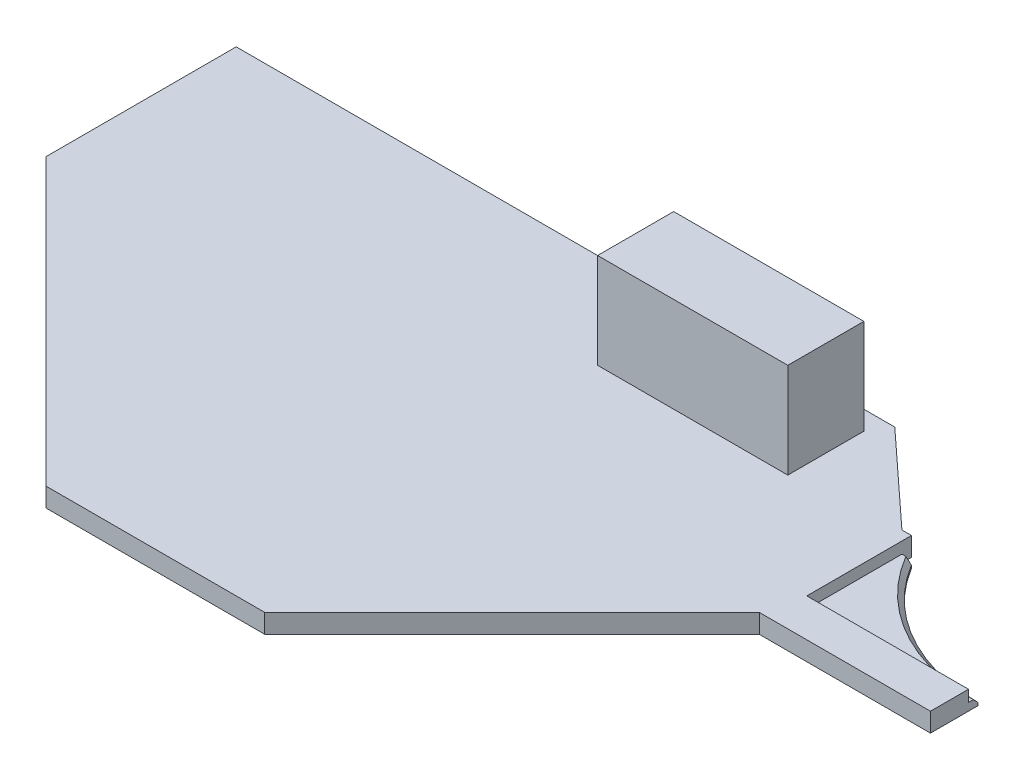
ISO-10303-21;
HEADER;
FILE_DESCRIPTION(('STEP AP214'),'2;1');
FILE_NAME('part.step','',(''),(''),'','','');
FILE_SCHEMA(('AUTOMOTIVE_DESIGN { 1 0 10303 214 1 1 1 1 }'));
ENDSEC;
DATA;
#1=APPLICATION_CONTEXT('core data for automotive mechanical design processes');
#2=APPLICATION_PROTOCOL_DEFINITION('international standard','automotive_design',2000,#1);
#3=PRODUCT_CONTEXT('',#1,'mechanical');
#4=PRODUCT('Part','Part','',(#3));
#5=PRODUCT_RELATED_PRODUCT_CATEGORY('part','',(#4));
#6=PRODUCT_DEFINITION_FORMATION('','',#4);
#7=PRODUCT_DEFINITION_CONTEXT('part definition',#1,'design');
#8=PRODUCT_DEFINITION('design','',#6,#7);
#9=PRODUCT_DEFINITION_SHAPE('','',#8);
#10=(LENGTH_UNIT() NAMED_UNIT(*) SI_UNIT(.MILLI.,.METRE.));
#11=(NAMED_UNIT(*) PLANE_ANGLE_UNIT() SI_UNIT($,.RADIAN.));
#12=(NAMED_UNIT(*) SI_UNIT($,.STERADIAN.) SOLID_ANGLE_UNIT());
#13=UNCERTAINTY_MEASURE_WITH_UNIT(LENGTH_MEASURE(1.E-05),#10,'distance_accuracy_value','');
#14=(GEOMETRIC_REPRESENTATION_CONTEXT(3) GLOBAL_UNCERTAINTY_ASSIGNED_CONTEXT((#13)) GLOBAL_UNIT_ASSIGNED_CONTEXT((#10,
#11,#12)) REPRESENTATION_CONTEXT('',''));
#15=CARTESIAN_POINT('',(0.,0.,0.));
#16=DIRECTION('',(0.,0.,1.));
#17=DIRECTION('',(1.,0.,0.));
#18=AXIS2_PLACEMENT_3D('',#15,#16,#17);
#19=CARTESIAN_POINT('',(0.,2.,0.));
#20=DIRECTION('',(0.,1.,0.));
#21=DIRECTION('',(0.,0.,1.));
#22=AXIS2_PLACEMENT_3D('',#19,#20,#21);
#23=PLANE('',#22);
#24=DIRECTION('',(0.,0.,1.));
#25=VECTOR('',#24,1.);
#26=CARTESIAN_POINT('',(80.,2.,-11.));
#27=LINE('',#26,#25);
#28=CARTESIAN_POINT('',(80.,2.,-11.));
#29=VERTEX_POINT('',#28);
#30=CARTESIAN_POINT('',(80.,2.,0.));
#31=VERTEX_POINT('',#30);
#32=EDGE_CURVE('E222',#29,#31,#27,.T.);
#33=ORIENTED_EDGE('',*,*,#32,.F.);
#34=DIRECTION('',(-1.,0.,0.));
#35=VECTOR('',#34,1.);
#36=CARTESIAN_POINT('',(79.,2.,-11.));
#37=LINE('',#36,#35);
#38=CARTESIAN_POINT('',(79.,2.,-11.));
#39=VERTEX_POINT('',#38);
#40=EDGE_CURVE('E259',#29,#39,#37,.T.);
#41=ORIENTED_EDGE('',*,*,#40,.T.);
#42=DIRECTION('',(-0.734803444627488,0.,-0.678280102733066));
#43=VECTOR('',#42,1.);
#44=CARTESIAN_POINT('',(69.25,2.,-20.));
#45=LINE('',#44,#43);
#46=CARTESIAN_POINT('',(69.25,2.,-20.));
#47=VERTEX_POINT('',#46);
#48=EDGE_CURVE('E261',#39,#47,#45,.T.);
#49=ORIENTED_EDGE('',*,*,#48,.T.);
#50=DIRECTION('',(-1.,0.,0.));
#51=VECTOR('',#50,1.);
#52=CARTESIAN_POINT('',(0.,2.,-20.));
#53=LINE('',#52,#51);
#54=CARTESIAN_POINT('',(0.,2.,-20.));
#55=VERTEX_POINT('',#54);
#56=EDGE_CURVE('E263',#47,#55,#53,.T.);
#57=ORIENTED_EDGE('',*,*,#56,.T.);
#58=DIRECTION('',(0.,0.,1.));
#59=VECTOR('',#58,1.);
#60=CARTESIAN_POINT('',(0.,2.,0.));
#61=LINE('',#60,#59);
#62=CARTESIAN_POINT('',(0.,2.,0.));
#63=VERTEX_POINT('',#62);
#64=EDGE_CURVE('E265',#55,#63,#61,.T.);
#65=ORIENTED_EDGE('',*,*,#64,.T.);
#66=DIRECTION('',(0.707106781186547,0.,0.707106781186548));
#67=VECTOR('',#66,1.);
#68=CARTESIAN_POINT('',(30.,2.,30.));
#69=LINE('',#68,#67);
#70=CARTESIAN_POINT('',(30.,2.,30.));
#71=VERTEX_POINT('',#70);
#72=EDGE_CURVE('E246',#63,#71,#69,.T.);
#73=ORIENTED_EDGE('',*,*,#72,.T.);
#74=DIRECTION('',(1.,0.,0.));
#75=VECTOR('',#74,1.);
#76=CARTESIAN_POINT('',(53.,2.,30.));
#77=LINE('',#76,#75);
#78=CARTESIAN_POINT('',(53.,2.,30.));
#79=VERTEX_POINT('',#78);
#80=EDGE_CURVE('E249',#71,#79,#77,.T.);
#81=ORIENTED_EDGE('',*,*,#80,.T.);
#82=DIRECTION('',(0.707106781186548,0.,-0.707106781186548));
#83=VECTOR('',#82,1.);
#84=CARTESIAN_POINT('',(79.,2.,4.));
#85=LINE('',#84,#83);
#86=CARTESIAN_POINT('',(79.,2.,4.));
#87=VERTEX_POINT('',#86);
#88=EDGE_CURVE('E252',#79,#87,#85,.T.);
#89=ORIENTED_EDGE('',*,*,#88,.T.);
#90=DIRECTION('',(1.,0.,0.));
#91=VECTOR('',#90,1.);
#92=CARTESIAN_POINT('',(79.,2.,4.));
#93=LINE('',#92,#91);
#94=CARTESIAN_POINT('',(97.,2.,4.));
#95=VERTEX_POINT('',#94);
#96=EDGE_CURVE('E254',#87,#95,#93,.T.);
#97=ORIENTED_EDGE('',*,*,#96,.T.);
#98=DIRECTION('',(0.,0.,-1.));
#99=VECTOR('',#98,1.);
#100=CARTESIAN_POINT('',(97.,2.,4.));
#101=LINE('',#100,#99);
#102=CARTESIAN_POINT('',(97.,2.,0.));
#103=VERTEX_POINT('',#102);
#104=EDGE_CURVE('E256',#95,#103,#101,.T.);
#105=ORIENTED_EDGE('',*,*,#104,.T.);
#106=DIRECTION('',(1.,0.,0.));
#107=VECTOR('',#106,1.);
#108=CARTESIAN_POINT('',(80.,2.,0.));
#109=LINE('',#108,#107);
#110=EDGE_CURVE('E235',#31,#103,#109,.T.);
#111=ORIENTED_EDGE('',*,*,#110,.F.);
#112=EDGE_LOOP('',(#33,#41,#49,#57,#65,#73,#81,#89,#97,#105,#111));
#113=FACE_BOUND('',#112,.T.);
#114=DIRECTION('',(0.,0.,-1.));
#115=VECTOR('',#114,1.);
#116=CARTESIAN_POINT('',(68.,2.,0.));
#117=LINE('',#116,#115);
#118=CARTESIAN_POINT('',(68.,2.,-9.99999999999999));
#119=VERTEX_POINT('',#118);
#120=CARTESIAN_POINT('',(68.,2.,-18.));
#121=VERTEX_POINT('',#120);
#122=EDGE_CURVE('E442',#119,#121,#117,.T.);
#123=ORIENTED_EDGE('',*,*,#122,.F.);
#124=DIRECTION('',(1.,0.,0.));
#125=VECTOR('',#124,1.);
#126=CARTESIAN_POINT('',(0.,2.,-9.99999999999999));
#127=LINE('',#126,#125);
#128=CARTESIAN_POINT('',(48.,2.,-9.99999999999999));
#129=VERTEX_POINT('',#128);
#130=EDGE_CURVE('E201',#129,#119,#127,.T.);
#131=ORIENTED_EDGE('',*,*,#130,.F.);
#132=DIRECTION('',(0.,0.,1.));
#133=VECTOR('',#132,1.);
#134=CARTESIAN_POINT('',(48.,2.,0.));
#135=LINE('',#134,#133);
#136=CARTESIAN_POINT('',(48.,2.,-18.));
#137=VERTEX_POINT('',#136);
#138=EDGE_CURVE('E197',#137,#129,#135,.T.);
#139=ORIENTED_EDGE('',*,*,#138,.F.);
#140=DIRECTION('',(-1.,0.,0.));
#141=VECTOR('',#140,1.);
#142=CARTESIAN_POINT('',(0.,2.,-18.));
#143=LINE('',#142,#141);
#144=EDGE_CURVE('E439',#121,#137,#143,.T.);
#145=ORIENTED_EDGE('',*,*,#144,.F.);
#146=EDGE_LOOP('',(#123,#131,#139,#145));
#147=FACE_BOUND('',#146,.T.);
#148=ADVANCED_FACE('F43',(#113,#147),#23,.T.);
#149=CARTESIAN_POINT('',(30.,2.,30.));
#150=DIRECTION('',(0.707106781186548,0.,-0.707106781186547));
#151=DIRECTION('',(-0.707106781186547,0.,-0.707106781186548));
#152=AXIS2_PLACEMENT_3D('',#149,#150,#151);
#153=PLANE('',#152);
#154=DIRECTION('',(0.707106781186547,0.,0.707106781186548));
#155=VECTOR('',#154,1.);
#156=CARTESIAN_POINT('',(30.,0.,30.));
#157=LINE('',#156,#155);
#158=CARTESIAN_POINT('',(0.,0.,0.));
#159=VERTEX_POINT('',#158);
#160=CARTESIAN_POINT('',(30.,0.,30.));
#161=VERTEX_POINT('',#160);
#162=EDGE_CURVE('E245',#159,#161,#157,.T.);
#163=ORIENTED_EDGE('',*,*,#162,.T.);
#164=DIRECTION('',(0.,-1.,0.));
#165=VECTOR('',#164,1.);
#166=CARTESIAN_POINT('',(30.,2.,30.));
#167=LINE('',#166,#165);
#168=EDGE_CURVE('E306',#71,#161,#167,.T.);
#169=ORIENTED_EDGE('',*,*,#168,.F.);
#170=ORIENTED_EDGE('',*,*,#72,.F.);
#171=DIRECTION('',(0.,-1.,0.));
#172=VECTOR('',#171,1.);
#173=CARTESIAN_POINT('',(0.,2.,0.));
#174=LINE('',#173,#172);
#175=EDGE_CURVE('E267',#63,#159,#174,.T.);
#176=ORIENTED_EDGE('',*,*,#175,.T.);
#177=EDGE_LOOP('',(#163,#169,#170,#176));
#178=FACE_BOUND('',#177,.T.);
#179=ADVANCED_FACE('F338',(#178),#153,.F.);
#180=CARTESIAN_POINT('',(53.,2.,30.));
#181=DIRECTION('',(0.,0.,-1.));
#182=DIRECTION('',(-1.,0.,0.));
#183=AXIS2_PLACEMENT_3D('',#180,#181,#182);
#184=PLANE('',#183);
#185=DIRECTION('',(1.,0.,0.));
#186=VECTOR('',#185,1.);
#187=CARTESIAN_POINT('',(53.,0.,30.));
#188=LINE('',#187,#186);
#189=CARTESIAN_POINT('',(53.,0.,30.));
#190=VERTEX_POINT('',#189);
#191=EDGE_CURVE('E270',#161,#190,#188,.T.);
#192=ORIENTED_EDGE('',*,*,#191,.T.);
#193=DIRECTION('',(0.,-1.,0.));
#194=VECTOR('',#193,1.);
#195=CARTESIAN_POINT('',(53.,2.,30.));
#196=LINE('',#195,#194);
#197=EDGE_CURVE('E303',#79,#190,#196,.T.);
#198=ORIENTED_EDGE('',*,*,#197,.F.);
#199=ORIENTED_EDGE('',*,*,#80,.F.);
#200=ORIENTED_EDGE('',*,*,#168,.T.);
#201=EDGE_LOOP('',(#192,#198,#199,#200));
#202=FACE_BOUND('',#201,.T.);
#203=ADVANCED_FACE('F344',(#202),#184,.F.);
#204=CARTESIAN_POINT('',(79.,2.,4.));
#205=DIRECTION('',(-0.707106781186548,0.,-0.707106781186547));
#206=DIRECTION('',(-0.707106781186547,0.,0.707106781186548));
#207=AXIS2_PLACEMENT_3D('',#204,#205,#206);
#208=PLANE('',#207);
#209=DIRECTION('',(0.707106781186548,0.,-0.707106781186548));
#210=VECTOR('',#209,1.);
#211=CARTESIAN_POINT('',(79.,0.,4.));
#212=LINE('',#211,#210);
#213=CARTESIAN_POINT('',(79.,0.,4.));
#214=VERTEX_POINT('',#213);
#215=EDGE_CURVE('E272',#190,#214,#212,.T.);
#216=ORIENTED_EDGE('',*,*,#215,.T.);
#217=DIRECTION('',(0.,-1.,0.));
#218=VECTOR('',#217,1.);
#219=CARTESIAN_POINT('',(79.,2.,4.));
#220=LINE('',#219,#218);
#221=EDGE_CURVE('E300',#87,#214,#220,.T.);
#222=ORIENTED_EDGE('',*,*,#221,.F.);
#223=ORIENTED_EDGE('',*,*,#88,.F.);
#224=ORIENTED_EDGE('',*,*,#197,.T.);
#225=EDGE_LOOP('',(#216,#222,#223,#224));
#226=FACE_BOUND('',#225,.T.);
#227=ADVANCED_FACE('F375',(#226),#208,.F.);
#228=CARTESIAN_POINT('',(79.,2.,4.));
#229=DIRECTION('',(0.,0.,-1.));
#230=DIRECTION('',(-1.,0.,0.));
#231=AXIS2_PLACEMENT_3D('',#228,#229,#230);
#232=PLANE('',#231);
#233=DIRECTION('',(1.,0.,0.));
#234=VECTOR('',#233,1.);
#235=CARTESIAN_POINT('',(79.,0.,4.));
#236=LINE('',#235,#234);
#237=CARTESIAN_POINT('',(97.,0.,4.));
#238=VERTEX_POINT('',#237);
#239=EDGE_CURVE('E274',#214,#238,#236,.T.);
#240=ORIENTED_EDGE('',*,*,#239,.T.);
#241=DIRECTION('',(0.,-1.,0.));
#242=VECTOR('',#241,1.);
#243=CARTESIAN_POINT('',(97.,2.,4.));
#244=LINE('',#243,#242);
#245=EDGE_CURVE('E297',#95,#238,#244,.T.);
#246=ORIENTED_EDGE('',*,*,#245,.F.);
#247=ORIENTED_EDGE('',*,*,#96,.F.);
#248=ORIENTED_EDGE('',*,*,#221,.T.);
#249=EDGE_LOOP('',(#240,#246,#247,#248));
#250=FACE_BOUND('',#249,.T.);
#251=ADVANCED_FACE('F372',(#250),#232,.F.);
#252=CARTESIAN_POINT('',(97.,2.,4.));
#253=DIRECTION('',(-1.,0.,0.));
#254=DIRECTION('',(0.,0.,1.));
#255=AXIS2_PLACEMENT_3D('',#252,#253,#254);
#256=PLANE('',#255);
#257=DIRECTION('',(0.,1.,0.));
#258=VECTOR('',#257,1.);
#259=CARTESIAN_POINT('',(97.,0.,-1.));
#260=LINE('',#259,#258);
#261=CARTESIAN_POINT('',(97.,0.,-1.));
#262=VERTEX_POINT('',#261);
#263=CARTESIAN_POINT('',(97.,0.299999999999992,-1.));
#264=VERTEX_POINT('',#263);
#265=EDGE_CURVE('E220',#262,#264,#260,.T.);
#266=ORIENTED_EDGE('',*,*,#265,.T.);
#267=DIRECTION('',(0.,0.707106781186545,0.70710678118655));
#268=VECTOR('',#267,1.);
#269=CARTESIAN_POINT('',(97.,-18.4222222222221,-19.7222222222222));
#270=LINE('',#269,#268);
#271=CARTESIAN_POINT('',(97.,0.799999999999999,-0.499999999999994));
#272=VERTEX_POINT('',#271);
#273=EDGE_CURVE('E70',#264,#272,#270,.T.);
#274=ORIENTED_EDGE('',*,*,#273,.T.);
#275=DIRECTION('',(0.,0.,1.));
#276=VECTOR('',#275,1.);
#277=CARTESIAN_POINT('',(97.,0.799999999999999,-11.));
#278=LINE('',#277,#276);
#279=CARTESIAN_POINT('',(97.,0.799999999999999,0.));
#280=VERTEX_POINT('',#279);
#281=EDGE_CURVE('E227',#272,#280,#278,.T.);
#282=ORIENTED_EDGE('',*,*,#281,.T.);
#283=DIRECTION('',(0.,1.,0.));
#284=VECTOR('',#283,1.);
#285=CARTESIAN_POINT('',(97.,-20.2484567313166,0.));
#286=LINE('',#285,#284);
#287=EDGE_CURVE('E239',#280,#103,#286,.T.);
#288=ORIENTED_EDGE('',*,*,#287,.T.);
#289=ORIENTED_EDGE('',*,*,#104,.F.);
#290=ORIENTED_EDGE('',*,*,#245,.T.);
#291=DIRECTION('',(0.,0.,-1.));
#292=VECTOR('',#291,1.);
#293=CARTESIAN_POINT('',(97.,0.,4.));
#294=LINE('',#293,#292);
#295=EDGE_CURVE('E276',#238,#262,#294,.T.);
#296=ORIENTED_EDGE('',*,*,#295,.T.);
#297=EDGE_LOOP('',(#266,#274,#282,#288,#289,#290,#296));
#298=FACE_BOUND('',#297,.T.);
#299=ADVANCED_FACE('F318',(#298),#256,.F.);
#300=CARTESIAN_POINT('',(79.,2.,-11.));
#301=DIRECTION('',(0.,0.,1.));
#302=DIRECTION('',(1.,0.,0.));
#303=AXIS2_PLACEMENT_3D('',#300,#301,#302);
#304=PLANE('',#303);
#305=DIRECTION('',(0.,1.,0.));
#306=VECTOR('',#305,1.);
#307=CARTESIAN_POINT('',(80.,-20.2484567313166,-11.));
#308=LINE('',#307,#306);
#309=CARTESIAN_POINT('',(80.,0.,-11.));
#310=VERTEX_POINT('',#309);
#311=EDGE_CURVE('E230',#310,#29,#308,.T.);
#312=ORIENTED_EDGE('',*,*,#311,.F.);
#313=DIRECTION('',(-1.,0.,0.));
#314=VECTOR('',#313,1.);
#315=CARTESIAN_POINT('',(79.,0.,-11.));
#316=LINE('',#315,#314);
#317=CARTESIAN_POINT('',(79.,0.,-11.));
#318=VERTEX_POINT('',#317);
#319=EDGE_CURVE('E279',#310,#318,#316,.T.);
#320=ORIENTED_EDGE('',*,*,#319,.T.);
#321=DIRECTION('',(0.,-1.,0.));
#322=VECTOR('',#321,1.);
#323=CARTESIAN_POINT('',(79.,2.,-11.));
#324=LINE('',#323,#322);
#325=EDGE_CURVE('E294',#39,#318,#324,.T.);
#326=ORIENTED_EDGE('',*,*,#325,.F.);
#327=ORIENTED_EDGE('',*,*,#40,.F.);
#328=EDGE_LOOP('',(#312,#320,#326,#327));
#329=FACE_BOUND('',#328,.T.);
#330=ADVANCED_FACE('F365',(#329),#304,.F.);
#331=CARTESIAN_POINT('',(69.25,2.,-20.));
#332=DIRECTION('',(-0.678280102733066,0.,0.734803444627488));
#333=DIRECTION('',(0.734803444627488,0.,0.678280102733066));
#334=AXIS2_PLACEMENT_3D('',#331,#332,#333);
#335=PLANE('',#334);
#336=DIRECTION('',(-0.734803444627488,0.,-0.678280102733066));
#337=VECTOR('',#336,1.);
#338=CARTESIAN_POINT('',(69.25,0.,-20.));
#339=LINE('',#338,#337);
#340=CARTESIAN_POINT('',(69.25,0.,-20.));
#341=VERTEX_POINT('',#340);
#342=EDGE_CURVE('E281',#318,#341,#339,.T.);
#343=ORIENTED_EDGE('',*,*,#342,.T.);
#344=DIRECTION('',(0.,-1.,0.));
#345=VECTOR('',#344,1.);
#346=CARTESIAN_POINT('',(69.25,2.,-20.));
#347=LINE('',#346,#345);
#348=EDGE_CURVE('E291',#47,#341,#347,.T.);
#349=ORIENTED_EDGE('',*,*,#348,.F.);
#350=ORIENTED_EDGE('',*,*,#48,.F.);
#351=ORIENTED_EDGE('',*,*,#325,.T.);
#352=EDGE_LOOP('',(#343,#349,#350,#351));
#353=FACE_BOUND('',#352,.T.);
#354=ADVANCED_FACE('F361',(#353),#335,.F.);
#355=CARTESIAN_POINT('',(0.,2.,-20.));
#356=DIRECTION('',(0.,0.,1.));
#357=DIRECTION('',(1.,0.,0.));
#358=AXIS2_PLACEMENT_3D('',#355,#356,#357);
#359=PLANE('',#358);
#360=DIRECTION('',(-1.,0.,0.));
#361=VECTOR('',#360,1.);
#362=CARTESIAN_POINT('',(0.,0.,-20.));
#363=LINE('',#362,#361);
#364=CARTESIAN_POINT('',(0.,0.,-20.));
#365=VERTEX_POINT('',#364);
#366=EDGE_CURVE('E283',#341,#365,#363,.T.);
#367=ORIENTED_EDGE('',*,*,#366,.T.);
#368=DIRECTION('',(0.,-1.,0.));
#369=VECTOR('',#368,1.);
#370=CARTESIAN_POINT('',(0.,2.,-20.));
#371=LINE('',#370,#369);
#372=EDGE_CURVE('E288',#55,#365,#371,.T.);
#373=ORIENTED_EDGE('',*,*,#372,.F.);
#374=ORIENTED_EDGE('',*,*,#56,.F.);
#375=ORIENTED_EDGE('',*,*,#348,.T.);
#376=EDGE_LOOP('',(#367,#373,#374,#375));
#377=FACE_BOUND('',#376,.T.);
#378=ADVANCED_FACE('F357',(#377),#359,.F.);
#379=CARTESIAN_POINT('',(0.,2.,0.));
#380=DIRECTION('',(1.,0.,0.));
#381=DIRECTION('',(0.,0.,-1.));
#382=AXIS2_PLACEMENT_3D('',#379,#380,#381);
#383=PLANE('',#382);
#384=DIRECTION('',(0.,0.,1.));
#385=VECTOR('',#384,1.);
#386=CARTESIAN_POINT('',(0.,0.,0.));
#387=LINE('',#386,#385);
#388=EDGE_CURVE('E250',#365,#159,#387,.T.);
#389=ORIENTED_EDGE('',*,*,#388,.T.);
#390=ORIENTED_EDGE('',*,*,#175,.F.);
#391=ORIENTED_EDGE('',*,*,#64,.F.);
#392=ORIENTED_EDGE('',*,*,#372,.T.);
#393=EDGE_LOOP('',(#389,#390,#391,#392));
#394=FACE_BOUND('',#393,.T.);
#395=ADVANCED_FACE('F354',(#394),#383,.F.);
#396=CARTESIAN_POINT('',(0.,0.,0.));
#397=DIRECTION('',(0.,1.,0.));
#398=DIRECTION('',(0.,0.,1.));
#399=AXIS2_PLACEMENT_3D('',#396,#397,#398);
#400=PLANE('',#399);
#401=DIRECTION('',(1.,0.,0.));
#402=VECTOR('',#401,1.);
#403=CARTESIAN_POINT('',(80.,0.,-10.));
#404=LINE('',#403,#402);
#405=CARTESIAN_POINT('',(80.,0.,-10.));
#406=VERTEX_POINT('',#405);
#407=CARTESIAN_POINT('',(81.,0.,-10.));
#408=VERTEX_POINT('',#407);
#409=EDGE_CURVE('E213',#406,#408,#404,.T.);
#410=ORIENTED_EDGE('',*,*,#409,.T.);
#411=CARTESIAN_POINT('',(97.,0.,-19.7222222222222));
#412=DIRECTION('',(0.,1.,0.));
#413=DIRECTION('',(0.,0.,1.));
#414=AXIS2_PLACEMENT_3D('',#411,#412,#413);
#415=CIRCLE('',#414,18.7222222222222);
#416=EDGE_CURVE('E216',#408,#262,#415,.T.);
#417=ORIENTED_EDGE('',*,*,#416,.T.);
#418=ORIENTED_EDGE('',*,*,#295,.F.);
#419=ORIENTED_EDGE('',*,*,#239,.F.);
#420=ORIENTED_EDGE('',*,*,#215,.F.);
#421=ORIENTED_EDGE('',*,*,#191,.F.);
#422=ORIENTED_EDGE('',*,*,#162,.F.);
#423=ORIENTED_EDGE('',*,*,#388,.F.);
#424=ORIENTED_EDGE('',*,*,#366,.F.);
#425=ORIENTED_EDGE('',*,*,#342,.F.);
#426=ORIENTED_EDGE('',*,*,#319,.F.);
#427=DIRECTION('',(0.,0.,1.));
#428=VECTOR('',#427,1.);
#429=CARTESIAN_POINT('',(80.,0.,-11.));
#430=LINE('',#429,#428);
#431=EDGE_CURVE('E205',#310,#406,#430,.T.);
#432=ORIENTED_EDGE('',*,*,#431,.T.);
#433=EDGE_LOOP('',(#410,#417,#418,#419,#420,#421,#422,#423,#424,#425,#426,#432));
#434=FACE_BOUND('',#433,.T.);
#435=ADVANCED_FACE('F324',(#434),#400,.F.);
#436=CARTESIAN_POINT('',(80.,-20.2484567313166,-11.));
#437=DIRECTION('',(-1.,0.,0.));
#438=DIRECTION('',(0.,0.,1.));
#439=AXIS2_PLACEMENT_3D('',#436,#437,#438);
#440=PLANE('',#439);
#441=DIRECTION('',(0.,0.,-1.));
#442=VECTOR('',#441,1.);
#443=CARTESIAN_POINT('',(80.,0.799999999999999,-11.));
#444=LINE('',#443,#442);
#445=CARTESIAN_POINT('',(80.,0.799999999999999,0.));
#446=VERTEX_POINT('',#445);
#447=CARTESIAN_POINT('',(80.,0.8,-10.));
#448=VERTEX_POINT('',#447);
#449=EDGE_CURVE('E229',#446,#448,#444,.T.);
#450=ORIENTED_EDGE('',*,*,#449,.T.);
#451=DIRECTION('',(0.,1.,0.));
#452=VECTOR('',#451,1.);
#453=CARTESIAN_POINT('',(80.,0.,-10.));
#454=LINE('',#453,#452);
#455=EDGE_CURVE('E218',#406,#448,#454,.T.);
#456=ORIENTED_EDGE('',*,*,#455,.F.);
#457=ORIENTED_EDGE('',*,*,#431,.F.);
#458=ORIENTED_EDGE('',*,*,#311,.T.);
#459=ORIENTED_EDGE('',*,*,#32,.T.);
#460=DIRECTION('',(0.,1.,0.));
#461=VECTOR('',#460,1.);
#462=CARTESIAN_POINT('',(80.,-20.2484567313166,0.));
#463=LINE('',#462,#461);
#464=EDGE_CURVE('E237',#446,#31,#463,.T.);
#465=ORIENTED_EDGE('',*,*,#464,.F.);
#466=EDGE_LOOP('',(#450,#456,#457,#458,#459,#465));
#467=FACE_BOUND('',#466,.T.);
#468=ADVANCED_FACE('F350',(#467),#440,.F.);
#469=CARTESIAN_POINT('',(80.,-20.2484567313166,0.));
#470=DIRECTION('',(0.,0.,1.));
#471=DIRECTION('',(1.,0.,0.));
#472=AXIS2_PLACEMENT_3D('',#469,#470,#471);
#473=PLANE('',#472);
#474=DIRECTION('',(-1.,0.,0.));
#475=VECTOR('',#474,1.);
#476=CARTESIAN_POINT('',(80.,0.799999999999999,0.));
#477=LINE('',#476,#475);
#478=EDGE_CURVE('E233',#280,#446,#477,.T.);
#479=ORIENTED_EDGE('',*,*,#478,.T.);
#480=ORIENTED_EDGE('',*,*,#464,.T.);
#481=ORIENTED_EDGE('',*,*,#110,.T.);
#482=ORIENTED_EDGE('',*,*,#287,.F.);
#483=EDGE_LOOP('',(#479,#480,#481,#482));
#484=FACE_BOUND('',#483,.T.);
#485=ADVANCED_FACE('F409',(#484),#473,.F.);
#486=CARTESIAN_POINT('',(0.,0.8,0.));
#487=DIRECTION('',(0.,1.,0.));
#488=DIRECTION('',(0.,0.,1.));
#489=AXIS2_PLACEMENT_3D('',#486,#487,#488);
#490=PLANE('',#489);
#491=ORIENTED_EDGE('',*,*,#281,.F.);
#492=CARTESIAN_POINT('',(97.,0.8,-19.7222222222222));
#493=DIRECTION('',(0.,1.,0.));
#494=DIRECTION('',(0.,0.,1.));
#495=AXIS2_PLACEMENT_3D('',#492,#493,#494);
#496=CIRCLE('',#495,19.2222222222222);
#497=CARTESIAN_POINT('',(80.4177136008866,0.8,-10.));
#498=VERTEX_POINT('',#497);
#499=EDGE_CURVE('E56',#272,#498,#496,.F.);
#500=ORIENTED_EDGE('',*,*,#499,.T.);
#501=DIRECTION('',(1.,0.,0.));
#502=VECTOR('',#501,1.);
#503=CARTESIAN_POINT('',(80.,0.8,-10.));
#504=LINE('',#503,#502);
#505=EDGE_CURVE('E203',#448,#498,#504,.T.);
#506=ORIENTED_EDGE('',*,*,#505,.F.);
#507=ORIENTED_EDGE('',*,*,#449,.F.);
#508=ORIENTED_EDGE('',*,*,#478,.F.);
#509=EDGE_LOOP('',(#491,#500,#506,#507,#508));
#510=FACE_BOUND('',#509,.T.);
#511=ADVANCED_FACE('F406',(#510),#490,.T.);
#512=CARTESIAN_POINT('',(97.,0.,-19.7222222222222));
#513=DIRECTION('',(0.,1.,0.));
#514=DIRECTION('',(0.,0.,1.));
#515=AXIS2_PLACEMENT_3D('',#512,#513,#514);
#516=CYLINDRICAL_SURFACE('',#515,18.7222222222222);
#517=DIRECTION('',(0.,1.,0.));
#518=VECTOR('',#517,1.);
#519=CARTESIAN_POINT('',(81.,0.,-10.));
#520=LINE('',#519,#518);
#521=CARTESIAN_POINT('',(81.,0.299999999999988,-10.));
#522=VERTEX_POINT('',#521);
#523=EDGE_CURVE('E223',#408,#522,#520,.T.);
#524=ORIENTED_EDGE('',*,*,#523,.T.);
#525=CARTESIAN_POINT('',(97.,0.299999999999989,-19.7222222222222));
#526=DIRECTION('',(0.,1.,0.));
#527=DIRECTION('',(0.,0.,1.));
#528=AXIS2_PLACEMENT_3D('',#525,#526,#527);
#529=CIRCLE('',#528,18.7222222222222);
#530=EDGE_CURVE('E309',#522,#264,#529,.T.);
#531=ORIENTED_EDGE('',*,*,#530,.T.);
#532=ORIENTED_EDGE('',*,*,#265,.F.);
#533=ORIENTED_EDGE('',*,*,#416,.F.);
#534=EDGE_LOOP('',(#524,#531,#532,#533));
#535=FACE_BOUND('',#534,.T.);
#536=ADVANCED_FACE('F314',(#535),#516,.F.);
#537=CARTESIAN_POINT('',(80.,0.,-10.));
#538=DIRECTION('',(0.,0.,1.));
#539=DIRECTION('',(1.,0.,0.));
#540=AXIS2_PLACEMENT_3D('',#537,#538,#539);
#541=PLANE('',#540);
#542=ORIENTED_EDGE('',*,*,#505,.T.);
#543=CARTESIAN_POINT('',(80.4177136008866,0.8,-10.));
#544=CARTESIAN_POINT('',(80.514567992752,0.716441510106282,-10.));
#545=CARTESIAN_POINT('',(80.6115190544153,0.632995599229627,-10.));
#546=CARTESIAN_POINT('',(80.8056145207795,0.466328932554971,-10.));
#547=CARTESIAN_POINT('',(80.9027589254874,0.383108176764955,-10.));
#548=CARTESIAN_POINT('',(81.,0.299999999999987,-10.));
#549=B_SPLINE_CURVE_WITH_KNOTS('',3,(#543,#544,#545,#546,#547,#548),.UNSPECIFIED.,.F.,.F.,(4,2,
4),(0.,0.383750642471212,0.7675012985524),.UNSPECIFIED.);
#550=EDGE_CURVE('E12',#498,#522,#549,.T.);
#551=ORIENTED_EDGE('',*,*,#550,.T.);
#552=ORIENTED_EDGE('',*,*,#523,.F.);
#553=ORIENTED_EDGE('',*,*,#409,.F.);
#554=ORIENTED_EDGE('',*,*,#455,.T.);
#555=EDGE_LOOP('',(#542,#551,#552,#553,#554));
#556=FACE_BOUND('',#555,.T.);
#557=ADVANCED_FACE('F330',(#556),#541,.F.);
#558=CARTESIAN_POINT('',(0.,12.,-9.99999999999999));
#559=DIRECTION('',(0.,0.,-1.));
#560=DIRECTION('',(-1.,0.,0.));
#561=AXIS2_PLACEMENT_3D('',#558,#559,#560);
#562=PLANE('',#561);
#563=ORIENTED_EDGE('',*,*,#130,.T.);
#564=DIRECTION('',(0.,-1.,0.));
#565=VECTOR('',#564,1.);
#566=CARTESIAN_POINT('',(68.,12.,-9.99999999999999));
#567=LINE('',#566,#565);
#568=CARTESIAN_POINT('',(68.,12.,-9.99999999999999));
#569=VERTEX_POINT('',#568);
#570=EDGE_CURVE('E181',#569,#119,#567,.T.);
#571=ORIENTED_EDGE('',*,*,#570,.F.);
#572=DIRECTION('',(1.,0.,0.));
#573=VECTOR('',#572,1.);
#574=CARTESIAN_POINT('',(0.,12.,-9.99999999999999));
#575=LINE('',#574,#573);
#576=CARTESIAN_POINT('',(48.,12.,-9.99999999999999));
#577=VERTEX_POINT('',#576);
#578=EDGE_CURVE('E188',#577,#569,#575,.T.);
#579=ORIENTED_EDGE('',*,*,#578,.F.);
#580=DIRECTION('',(0.,-1.,0.));
#581=VECTOR('',#580,1.);
#582=CARTESIAN_POINT('',(48.,12.,-9.99999999999999));
#583=LINE('',#582,#581);
#584=EDGE_CURVE('E435',#577,#129,#583,.T.);
#585=ORIENTED_EDGE('',*,*,#584,.T.);
#586=EDGE_LOOP('',(#563,#571,#579,#585));
#587=FACE_BOUND('',#586,.T.);
#588=ADVANCED_FACE('F199',(#587),#562,.F.);
#589=CARTESIAN_POINT('',(68.,12.,0.));
#590=DIRECTION('',(-1.,0.,0.));
#591=DIRECTION('',(0.,0.,1.));
#592=AXIS2_PLACEMENT_3D('',#589,#590,#591);
#593=PLANE('',#592);
#594=ORIENTED_EDGE('',*,*,#122,.T.);
#595=DIRECTION('',(0.,-1.,0.));
#596=VECTOR('',#595,1.);
#597=CARTESIAN_POINT('',(68.,12.,-18.));
#598=LINE('',#597,#596);
#599=CARTESIAN_POINT('',(68.,12.,-18.));
#600=VERTEX_POINT('',#599);
#601=EDGE_CURVE('E184',#600,#121,#598,.T.);
#602=ORIENTED_EDGE('',*,*,#601,.F.);
#603=DIRECTION('',(0.,0.,-1.));
#604=VECTOR('',#603,1.);
#605=CARTESIAN_POINT('',(68.,12.,0.));
#606=LINE('',#605,#604);
#607=EDGE_CURVE('E177',#569,#600,#606,.T.);
#608=ORIENTED_EDGE('',*,*,#607,.F.);
#609=ORIENTED_EDGE('',*,*,#570,.T.);
#610=EDGE_LOOP('',(#594,#602,#608,#609));
#611=FACE_BOUND('',#610,.T.);
#612=ADVANCED_FACE('F179',(#611),#593,.F.);
#613=CARTESIAN_POINT('',(0.,12.,-18.));
#614=DIRECTION('',(0.,0.,1.));
#615=DIRECTION('',(1.,0.,0.));
#616=AXIS2_PLACEMENT_3D('',#613,#614,#615);
#617=PLANE('',#616);
#618=ORIENTED_EDGE('',*,*,#144,.T.);
#619=DIRECTION('',(0.,-1.,0.));
#620=VECTOR('',#619,1.);
#621=CARTESIAN_POINT('',(48.,12.,-18.));
#622=LINE('',#621,#620);
#623=CARTESIAN_POINT('',(48.,12.,-18.));
#624=VERTEX_POINT('',#623);
#625=EDGE_CURVE('E207',#624,#137,#622,.T.);
#626=ORIENTED_EDGE('',*,*,#625,.F.);
#627=DIRECTION('',(-1.,0.,0.));
#628=VECTOR('',#627,1.);
#629=CARTESIAN_POINT('',(0.,12.,-18.));
#630=LINE('',#629,#628);
#631=EDGE_CURVE('E187',#600,#624,#630,.T.);
#632=ORIENTED_EDGE('',*,*,#631,.F.);
#633=ORIENTED_EDGE('',*,*,#601,.T.);
#634=EDGE_LOOP('',(#618,#626,#632,#633));
#635=FACE_BOUND('',#634,.T.);
#636=ADVANCED_FACE('F426',(#635),#617,.F.);
#637=CARTESIAN_POINT('',(48.,12.,0.));
#638=DIRECTION('',(1.,0.,0.));
#639=DIRECTION('',(0.,0.,-1.));
#640=AXIS2_PLACEMENT_3D('',#637,#638,#639);
#641=PLANE('',#640);
#642=ORIENTED_EDGE('',*,*,#138,.T.);
#643=ORIENTED_EDGE('',*,*,#584,.F.);
#644=DIRECTION('',(0.,0.,1.));
#645=VECTOR('',#644,1.);
#646=CARTESIAN_POINT('',(48.,12.,0.));
#647=LINE('',#646,#645);
#648=EDGE_CURVE('E193',#624,#577,#647,.T.);
#649=ORIENTED_EDGE('',*,*,#648,.F.);
#650=ORIENTED_EDGE('',*,*,#625,.T.);
#651=EDGE_LOOP('',(#642,#643,#649,#650));
#652=FACE_BOUND('',#651,.T.);
#653=ADVANCED_FACE('F335',(#652),#641,.F.);
#654=CARTESIAN_POINT('',(0.,12.,0.));
#655=DIRECTION('',(0.,1.,0.));
#656=DIRECTION('',(0.,0.,1.));
#657=AXIS2_PLACEMENT_3D('',#654,#655,#656);
#658=PLANE('',#657);
#659=ORIENTED_EDGE('',*,*,#578,.T.);
#660=ORIENTED_EDGE('',*,*,#607,.T.);
#661=ORIENTED_EDGE('',*,*,#631,.T.);
#662=ORIENTED_EDGE('',*,*,#648,.T.);
#663=EDGE_LOOP('',(#659,#660,#661,#662));
#664=FACE_BOUND('',#663,.T.);
#665=ADVANCED_FACE('F191',(#664),#658,.T.);
#666=CARTESIAN_POINT('',(97.,0.299999999999989,-19.7222222222222));
#667=DIRECTION('',(0.,1.,0.));
#668=DIRECTION('',(0.,0.,1.));
#669=AXIS2_PLACEMENT_3D('',#666,#667,#668);
#670=CONICAL_SURFACE('',#669,18.7222222222222,0.785398163397452);
#671=ORIENTED_EDGE('',*,*,#550,.F.);
#672=ORIENTED_EDGE('',*,*,#499,.F.);
#673=ORIENTED_EDGE('',*,*,#273,.F.);
#674=ORIENTED_EDGE('',*,*,#530,.F.);
#675=EDGE_LOOP('',(#671,#672,#673,#674));
#676=FACE_BOUND('',#675,.T.);
#677=ADVANCED_FACE('F45',(#676),#670,.F.);
#678=CLOSED_SHELL('',(#148,#179,#203,#227,#251,#299,#330,#354,#378,#395,#435,#468,#485,#511,
#536,#557,#588,#612,#636,#653,#665,#677));
#679=MANIFOLD_SOLID_BREP('B2',#678);
#680=ADVANCED_BREP_SHAPE_REPRESENTATION('',(#18,#679),#14);
#681=SHAPE_DEFINITION_REPRESENTATION(#9,#680);
ENDSEC;
END-ISO-10303-21;
